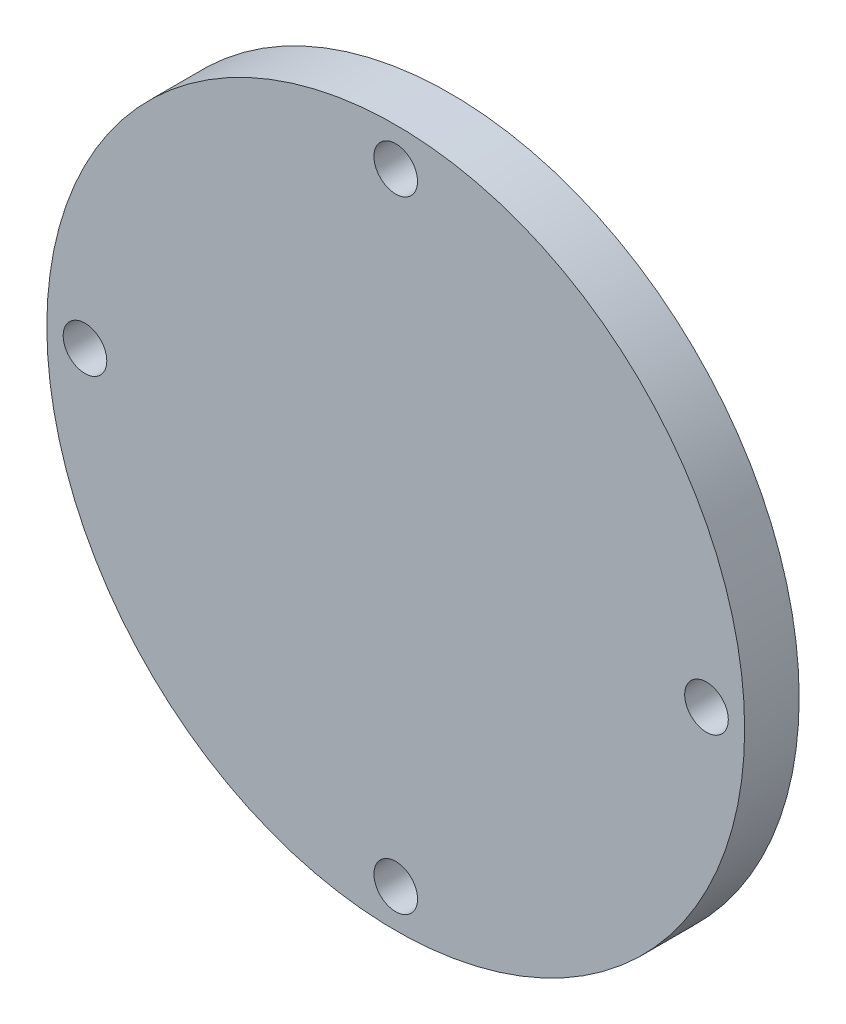
ISO-10303-21;
HEADER;
FILE_DESCRIPTION(('STEP AP214'),'2;1');
FILE_NAME('part.step','',(''),(''),'','','');
FILE_SCHEMA(('AUTOMOTIVE_DESIGN { 1 0 10303 214 1 1 1 1 }'));
ENDSEC;
DATA;
#1=APPLICATION_CONTEXT('core data for automotive mechanical design processes');
#2=APPLICATION_PROTOCOL_DEFINITION('international standard','automotive_design',2000,#1);
#3=PRODUCT_CONTEXT('',#1,'mechanical');
#4=PRODUCT('Part','Part','',(#3));
#5=PRODUCT_RELATED_PRODUCT_CATEGORY('part','',(#4));
#6=PRODUCT_DEFINITION_FORMATION('','',#4);
#7=PRODUCT_DEFINITION_CONTEXT('part definition',#1,'design');
#8=PRODUCT_DEFINITION('design','',#6,#7);
#9=PRODUCT_DEFINITION_SHAPE('','',#8);
#10=(LENGTH_UNIT() NAMED_UNIT(*) SI_UNIT(.MILLI.,.METRE.));
#11=(NAMED_UNIT(*) PLANE_ANGLE_UNIT() SI_UNIT($,.RADIAN.));
#12=(NAMED_UNIT(*) SI_UNIT($,.STERADIAN.) SOLID_ANGLE_UNIT());
#13=UNCERTAINTY_MEASURE_WITH_UNIT(LENGTH_MEASURE(1.E-05),#10,'distance_accuracy_value','');
#14=(GEOMETRIC_REPRESENTATION_CONTEXT(3) GLOBAL_UNCERTAINTY_ASSIGNED_CONTEXT((#13)) GLOBAL_UNIT_ASSIGNED_CONTEXT((#10,
#11,#12)) REPRESENTATION_CONTEXT('',''));
#15=CARTESIAN_POINT('',(0.,0.,0.));
#16=DIRECTION('',(0.,0.,1.));
#17=DIRECTION('',(1.,0.,0.));
#18=AXIS2_PLACEMENT_3D('',#15,#16,#17);
#19=CARTESIAN_POINT('',(0.,0.,5.));
#20=DIRECTION('',(0.,0.,1.));
#21=DIRECTION('',(1.,0.,0.));
#22=AXIS2_PLACEMENT_3D('',#19,#20,#21);
#23=PLANE('',#22);
#24=CARTESIAN_POINT('',(1.58138992732974E-12,-28.5,5.));
#25=DIRECTION('',(0.,0.,1.));
#26=DIRECTION('',(1.,0.,0.));
#27=AXIS2_PLACEMENT_3D('',#24,#25,#26);
#28=CIRCLE('',#27,2.);
#29=CARTESIAN_POINT('',(2.00000000000158,-28.5,5.));
#30=VERTEX_POINT('',#29);
#31=EDGE_CURVE('E72',#30,#30,#28,.T.);
#32=ORIENTED_EDGE('',*,*,#31,.F.);
#33=EDGE_LOOP('',(#32));
#34=FACE_BOUND('',#33,.T.);
#35=CARTESIAN_POINT('',(0.,28.5,5.));
#36=DIRECTION('',(0.,0.,1.));
#37=DIRECTION('',(1.,0.,0.));
#38=AXIS2_PLACEMENT_3D('',#35,#36,#37);
#39=CIRCLE('',#38,2.);
#40=CARTESIAN_POINT('',(2.,28.5,5.));
#41=VERTEX_POINT('',#40);
#42=EDGE_CURVE('E58',#41,#41,#39,.T.);
#43=ORIENTED_EDGE('',*,*,#42,.F.);
#44=EDGE_LOOP('',(#43));
#45=FACE_BOUND('',#44,.T.);
#46=CARTESIAN_POINT('',(0.,0.,5.));
#47=DIRECTION('',(0.,0.,1.));
#48=DIRECTION('',(1.,0.,0.));
#49=AXIS2_PLACEMENT_3D('',#46,#47,#48);
#50=CIRCLE('',#49,32.);
#51=CARTESIAN_POINT('',(32.,0.,5.));
#52=VERTEX_POINT('',#51);
#53=EDGE_CURVE('E10',#52,#52,#50,.T.);
#54=ORIENTED_EDGE('',*,*,#53,.T.);
#55=EDGE_LOOP('',(#54));
#56=FACE_BOUND('',#55,.T.);
#57=CARTESIAN_POINT('',(28.5000000000008,7.90694963664872E-13,5.));
#58=DIRECTION('',(0.,0.,1.));
#59=DIRECTION('',(1.,0.,0.));
#60=AXIS2_PLACEMENT_3D('',#57,#58,#59);
#61=CIRCLE('',#60,2.);
#62=CARTESIAN_POINT('',(30.5000000000008,7.90694963664872E-13,5.));
#63=VERTEX_POINT('',#62);
#64=EDGE_CURVE('E64',#63,#63,#61,.T.);
#65=ORIENTED_EDGE('',*,*,#64,.F.);
#66=EDGE_LOOP('',(#65));
#67=FACE_BOUND('',#66,.T.);
#68=CARTESIAN_POINT('',(-28.4999999999992,-7.94185207042442E-13,5.));
#69=DIRECTION('',(0.,0.,1.));
#70=DIRECTION('',(1.,0.,0.));
#71=AXIS2_PLACEMENT_3D('',#68,#69,#70);
#72=CIRCLE('',#71,2.);
#73=CARTESIAN_POINT('',(-26.4999999999992,-7.94185207042442E-13,5.));
#74=VERTEX_POINT('',#73);
#75=EDGE_CURVE('E80',#74,#74,#72,.T.);
#76=ORIENTED_EDGE('',*,*,#75,.F.);
#77=EDGE_LOOP('',(#76));
#78=FACE_BOUND('',#77,.T.);
#79=ADVANCED_FACE('F45',(#34,#45,#56,#67,#78),#23,.T.);
#80=CARTESIAN_POINT('',(0.,0.,0.));
#81=DIRECTION('',(0.,0.,1.));
#82=DIRECTION('',(1.,0.,0.));
#83=AXIS2_PLACEMENT_3D('',#80,#81,#82);
#84=PLANE('',#83);
#85=CARTESIAN_POINT('',(0.,0.,0.));
#86=DIRECTION('',(0.,0.,1.));
#87=DIRECTION('',(1.,0.,0.));
#88=AXIS2_PLACEMENT_3D('',#85,#86,#87);
#89=CIRCLE('',#88,32.);
#90=CARTESIAN_POINT('',(32.,0.,0.));
#91=VERTEX_POINT('',#90);
#92=EDGE_CURVE('E49',#91,#91,#89,.T.);
#93=ORIENTED_EDGE('',*,*,#92,.F.);
#94=EDGE_LOOP('',(#93));
#95=FACE_BOUND('',#94,.T.);
#96=CARTESIAN_POINT('',(0.,28.5,0.));
#97=DIRECTION('',(0.,0.,1.));
#98=DIRECTION('',(1.,0.,0.));
#99=AXIS2_PLACEMENT_3D('',#96,#97,#98);
#100=CIRCLE('',#99,2.);
#101=CARTESIAN_POINT('',(2.,28.5,0.));
#102=VERTEX_POINT('',#101);
#103=EDGE_CURVE('E60',#102,#102,#100,.T.);
#104=ORIENTED_EDGE('',*,*,#103,.T.);
#105=EDGE_LOOP('',(#104));
#106=FACE_BOUND('',#105,.T.);
#107=CARTESIAN_POINT('',(28.5000000000008,7.90694963664872E-13,0.));
#108=DIRECTION('',(0.,0.,1.));
#109=DIRECTION('',(1.,0.,0.));
#110=AXIS2_PLACEMENT_3D('',#107,#108,#109);
#111=CIRCLE('',#110,2.);
#112=CARTESIAN_POINT('',(30.5000000000008,7.90694963664872E-13,0.));
#113=VERTEX_POINT('',#112);
#114=EDGE_CURVE('E68',#113,#113,#111,.T.);
#115=ORIENTED_EDGE('',*,*,#114,.T.);
#116=EDGE_LOOP('',(#115));
#117=FACE_BOUND('',#116,.T.);
#118=CARTESIAN_POINT('',(1.58138992732974E-12,-28.5,0.));
#119=DIRECTION('',(0.,0.,1.));
#120=DIRECTION('',(1.,0.,0.));
#121=AXIS2_PLACEMENT_3D('',#118,#119,#120);
#122=CIRCLE('',#121,2.);
#123=CARTESIAN_POINT('',(2.00000000000158,-28.5,0.));
#124=VERTEX_POINT('',#123);
#125=EDGE_CURVE('E76',#124,#124,#122,.T.);
#126=ORIENTED_EDGE('',*,*,#125,.T.);
#127=EDGE_LOOP('',(#126));
#128=FACE_BOUND('',#127,.T.);
#129=CARTESIAN_POINT('',(-28.4999999999992,-7.94185207042442E-13,0.));
#130=DIRECTION('',(0.,0.,1.));
#131=DIRECTION('',(1.,0.,0.));
#132=AXIS2_PLACEMENT_3D('',#129,#130,#131);
#133=CIRCLE('',#132,2.);
#134=CARTESIAN_POINT('',(-26.4999999999992,-7.94185207042442E-13,0.));
#135=VERTEX_POINT('',#134);
#136=EDGE_CURVE('E84',#135,#135,#133,.T.);
#137=ORIENTED_EDGE('',*,*,#136,.T.);
#138=EDGE_LOOP('',(#137));
#139=FACE_BOUND('',#138,.T.);
#140=ADVANCED_FACE('F96',(#95,#106,#117,#128,#139),#84,.F.);
#141=CARTESIAN_POINT('',(0.,0.,5.));
#142=DIRECTION('',(0.,0.,-1.));
#143=DIRECTION('',(-1.,0.,0.));
#144=AXIS2_PLACEMENT_3D('',#141,#142,#143);
#145=CYLINDRICAL_SURFACE('',#144,32.);
#146=ORIENTED_EDGE('',*,*,#53,.F.);
#147=EDGE_LOOP('',(#146));
#148=FACE_BOUND('',#147,.T.);
#149=ORIENTED_EDGE('',*,*,#92,.T.);
#150=EDGE_LOOP('',(#149));
#151=FACE_BOUND('',#150,.T.);
#152=ADVANCED_FACE('F47',(#148,#151),#145,.T.);
#153=CARTESIAN_POINT('',(0.,28.5,5.));
#154=DIRECTION('',(0.,0.,-1.));
#155=DIRECTION('',(-1.,0.,0.));
#156=AXIS2_PLACEMENT_3D('',#153,#154,#155);
#157=CYLINDRICAL_SURFACE('',#156,2.);
#158=ORIENTED_EDGE('',*,*,#42,.T.);
#159=EDGE_LOOP('',(#158));
#160=FACE_BOUND('',#159,.T.);
#161=ORIENTED_EDGE('',*,*,#103,.F.);
#162=EDGE_LOOP('',(#161));
#163=FACE_BOUND('',#162,.T.);
#164=ADVANCED_FACE('F106',(#160,#163),#157,.F.);
#165=CARTESIAN_POINT('',(28.5000000000008,7.90694963664872E-13,5.));
#166=DIRECTION('',(0.,0.,-1.));
#167=DIRECTION('',(-1.,0.,0.));
#168=AXIS2_PLACEMENT_3D('',#165,#166,#167);
#169=CYLINDRICAL_SURFACE('',#168,2.);
#170=ORIENTED_EDGE('',*,*,#64,.T.);
#171=EDGE_LOOP('',(#170));
#172=FACE_BOUND('',#171,.T.);
#173=ORIENTED_EDGE('',*,*,#114,.F.);
#174=EDGE_LOOP('',(#173));
#175=FACE_BOUND('',#174,.T.);
#176=ADVANCED_FACE('F109',(#172,#175),#169,.F.);
#177=CARTESIAN_POINT('',(1.58138992732974E-12,-28.5,5.));
#178=DIRECTION('',(0.,0.,-1.));
#179=DIRECTION('',(-1.,0.,0.));
#180=AXIS2_PLACEMENT_3D('',#177,#178,#179);
#181=CYLINDRICAL_SURFACE('',#180,2.);
#182=ORIENTED_EDGE('',*,*,#31,.T.);
#183=EDGE_LOOP('',(#182));
#184=FACE_BOUND('',#183,.T.);
#185=ORIENTED_EDGE('',*,*,#125,.F.);
#186=EDGE_LOOP('',(#185));
#187=FACE_BOUND('',#186,.T.);
#188=ADVANCED_FACE('F113',(#184,#187),#181,.F.);
#189=CARTESIAN_POINT('',(-28.4999999999992,-7.94185207042442E-13,5.));
#190=DIRECTION('',(0.,0.,-1.));
#191=DIRECTION('',(-1.,0.,0.));
#192=AXIS2_PLACEMENT_3D('',#189,#190,#191);
#193=CYLINDRICAL_SURFACE('',#192,2.);
#194=ORIENTED_EDGE('',*,*,#75,.T.);
#195=EDGE_LOOP('',(#194));
#196=FACE_BOUND('',#195,.T.);
#197=ORIENTED_EDGE('',*,*,#136,.F.);
#198=EDGE_LOOP('',(#197));
#199=FACE_BOUND('',#198,.T.);
#200=ADVANCED_FACE('F92',(#196,#199),#193,.F.);
#201=CLOSED_SHELL('',(#79,#140,#152,#164,#176,#188,#200));
#202=MANIFOLD_SOLID_BREP('B2',#201);
#203=ADVANCED_BREP_SHAPE_REPRESENTATION('',(#18,#202),#14);
#204=SHAPE_DEFINITION_REPRESENTATION(#9,#203);
ENDSEC;
END-ISO-10303-21;
